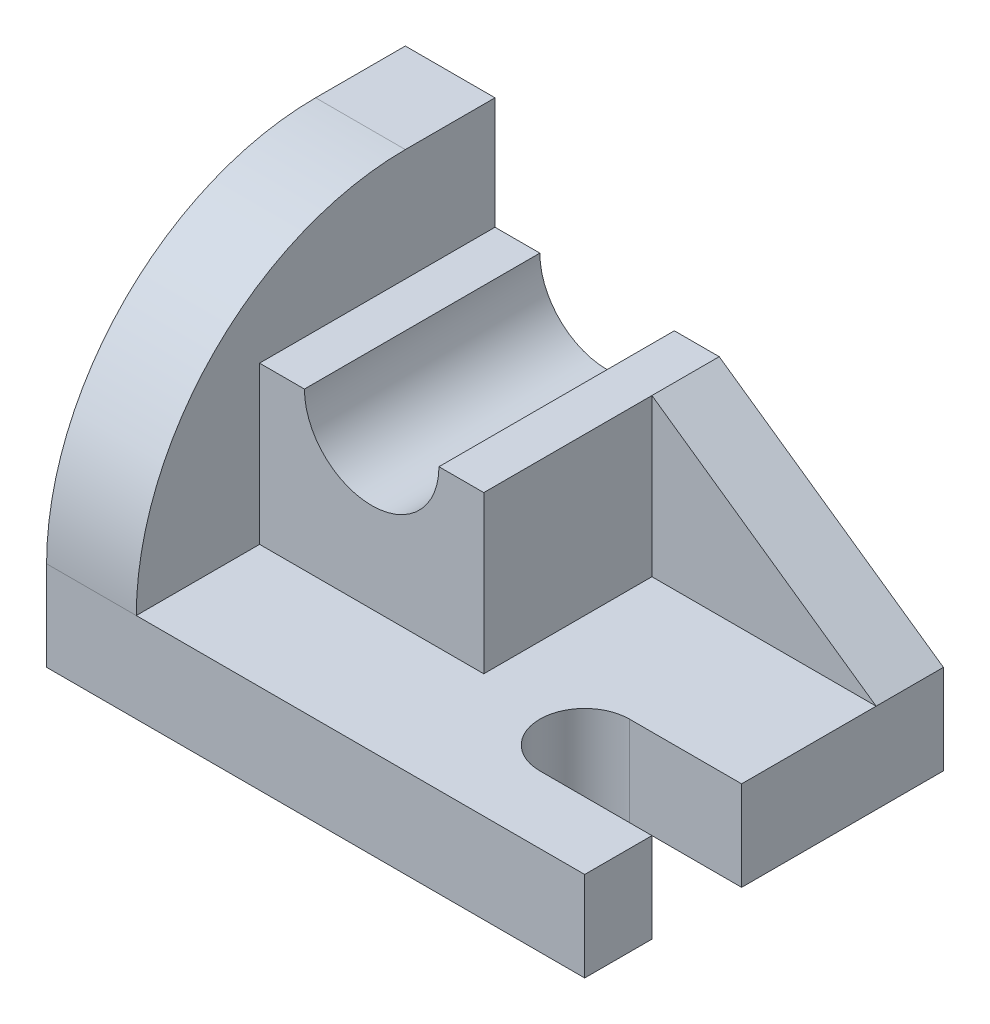
ISO-10303-21;
HEADER;
FILE_DESCRIPTION(('STEP AP214'),'2;1');
FILE_NAME('part.step','',(''),(''),'','','');
FILE_SCHEMA(('AUTOMOTIVE_DESIGN { 1 0 10303 214 1 1 1 1 }'));
ENDSEC;
DATA;
#1=APPLICATION_CONTEXT('core data for automotive mechanical design processes');
#2=APPLICATION_PROTOCOL_DEFINITION('international standard','automotive_design',2000,#1);
#3=PRODUCT_CONTEXT('',#1,'mechanical');
#4=PRODUCT('Part','Part','',(#3));
#5=PRODUCT_RELATED_PRODUCT_CATEGORY('part','',(#4));
#6=PRODUCT_DEFINITION_FORMATION('','',#4);
#7=PRODUCT_DEFINITION_CONTEXT('part definition',#1,'design');
#8=PRODUCT_DEFINITION('design','',#6,#7);
#9=PRODUCT_DEFINITION_SHAPE('','',#8);
#10=(LENGTH_UNIT() NAMED_UNIT(*) SI_UNIT(.MILLI.,.METRE.));
#11=(NAMED_UNIT(*) PLANE_ANGLE_UNIT() SI_UNIT($,.RADIAN.));
#12=(NAMED_UNIT(*) SI_UNIT($,.STERADIAN.) SOLID_ANGLE_UNIT());
#13=UNCERTAINTY_MEASURE_WITH_UNIT(LENGTH_MEASURE(1.E-05),#10,'distance_accuracy_value','');
#14=(GEOMETRIC_REPRESENTATION_CONTEXT(3) GLOBAL_UNCERTAINTY_ASSIGNED_CONTEXT((#13)) GLOBAL_UNIT_ASSIGNED_CONTEXT((#10,
#11,#12)) REPRESENTATION_CONTEXT('',''));
#15=CARTESIAN_POINT('',(0.,0.,0.));
#16=DIRECTION('',(0.,0.,1.));
#17=DIRECTION('',(1.,0.,0.));
#18=AXIS2_PLACEMENT_3D('',#15,#16,#17);
#19=CARTESIAN_POINT('',(0.,8.,0.));
#20=DIRECTION('',(0.,1.,0.));
#21=DIRECTION('',(0.,0.,1.));
#22=AXIS2_PLACEMENT_3D('',#19,#20,#21);
#23=PLANE('',#22);
#24=DIRECTION('',(-1.,0.,0.));
#25=VECTOR('',#24,1.);
#26=CARTESIAN_POINT('',(48.,8.,-20.));
#27=LINE('',#26,#25);
#28=CARTESIAN_POINT('',(48.,8.,-20.));
#29=VERTEX_POINT('',#28);
#30=CARTESIAN_POINT('',(7.99999999999999,8.,-20.));
#31=VERTEX_POINT('',#30);
#32=EDGE_CURVE('E239',#29,#31,#27,.T.);
#33=ORIENTED_EDGE('',*,*,#32,.T.);
#34=DIRECTION('',(0.,0.,-1.));
#35=VECTOR('',#34,1.);
#36=CARTESIAN_POINT('',(7.99999999999999,8.,10.));
#37=LINE('',#36,#35);
#38=CARTESIAN_POINT('',(7.99999999999999,8.,10.));
#39=VERTEX_POINT('',#38);
#40=EDGE_CURVE('E194',#39,#31,#37,.T.);
#41=ORIENTED_EDGE('',*,*,#40,.F.);
#42=DIRECTION('',(1.,0.,0.));
#43=VECTOR('',#42,1.);
#44=CARTESIAN_POINT('',(0.,8.,10.));
#45=LINE('',#44,#43);
#46=CARTESIAN_POINT('',(-32.,8.,10.));
#47=VERTEX_POINT('',#46);
#48=EDGE_CURVE('E219',#47,#39,#45,.T.);
#49=ORIENTED_EDGE('',*,*,#48,.F.);
#50=DIRECTION('',(0.,0.,1.));
#51=VECTOR('',#50,1.);
#52=CARTESIAN_POINT('',(-32.,8.,-32.));
#53=LINE('',#52,#51);
#54=CARTESIAN_POINT('',(-32.,8.,32.));
#55=VERTEX_POINT('',#54);
#56=EDGE_CURVE('E55',#47,#55,#53,.T.);
#57=ORIENTED_EDGE('',*,*,#56,.T.);
#58=DIRECTION('',(1.,0.,0.));
#59=VECTOR('',#58,1.);
#60=CARTESIAN_POINT('',(0.,8.,32.));
#61=LINE('',#60,#59);
#62=CARTESIAN_POINT('',(48.,8.,32.));
#63=VERTEX_POINT('',#62);
#64=EDGE_CURVE('E106',#55,#63,#61,.T.);
#65=ORIENTED_EDGE('',*,*,#64,.T.);
#66=DIRECTION('',(0.,0.,-1.));
#67=VECTOR('',#66,1.);
#68=CARTESIAN_POINT('',(48.,8.,0.));
#69=LINE('',#68,#67);
#70=CARTESIAN_POINT('',(48.,8.,20.));
#71=VERTEX_POINT('',#70);
#72=EDGE_CURVE('E111',#63,#71,#69,.T.);
#73=ORIENTED_EDGE('',*,*,#72,.T.);
#74=DIRECTION('',(1.,0.,0.));
#75=VECTOR('',#74,1.);
#76=CARTESIAN_POINT('',(0.,8.,20.));
#77=LINE('',#76,#75);
#78=CARTESIAN_POINT('',(28.,8.,20.));
#79=VERTEX_POINT('',#78);
#80=EDGE_CURVE('E133',#79,#71,#77,.T.);
#81=ORIENTED_EDGE('',*,*,#80,.F.);
#82=CARTESIAN_POINT('',(28.,8.,12.));
#83=DIRECTION('',(0.,1.,0.));
#84=DIRECTION('',(0.,0.,1.));
#85=AXIS2_PLACEMENT_3D('',#82,#83,#84);
#86=CIRCLE('',#85,8.);
#87=CARTESIAN_POINT('',(28.,8.,4.));
#88=VERTEX_POINT('',#87);
#89=EDGE_CURVE('E146',#88,#79,#86,.T.);
#90=ORIENTED_EDGE('',*,*,#89,.F.);
#91=DIRECTION('',(1.,0.,0.));
#92=VECTOR('',#91,1.);
#93=CARTESIAN_POINT('',(0.,8.,4.));
#94=LINE('',#93,#92);
#95=CARTESIAN_POINT('',(48.,8.,4.));
#96=VERTEX_POINT('',#95);
#97=EDGE_CURVE('E142',#88,#96,#94,.T.);
#98=ORIENTED_EDGE('',*,*,#97,.T.);
#99=EDGE_CURVE('E117',#96,#29,#69,.T.);
#100=ORIENTED_EDGE('',*,*,#99,.T.);
#101=EDGE_LOOP('',(#33,#41,#49,#57,#65,#73,#81,#90,#98,#100));
#102=FACE_BOUND('',#101,.T.);
#103=ADVANCED_FACE('F39',(#102),#23,.T.);
#104=CARTESIAN_POINT('',(28.,8.,12.));
#105=DIRECTION('',(0.,-1.,0.));
#106=DIRECTION('',(0.,0.,-1.));
#107=AXIS2_PLACEMENT_3D('',#104,#105,#106);
#108=CYLINDRICAL_SURFACE('',#107,8.);
#109=CARTESIAN_POINT('',(28.,-8.,12.));
#110=DIRECTION('',(0.,1.,0.));
#111=DIRECTION('',(0.,0.,1.));
#112=AXIS2_PLACEMENT_3D('',#109,#110,#111);
#113=CIRCLE('',#112,8.);
#114=CARTESIAN_POINT('',(28.,-8.,4.));
#115=VERTEX_POINT('',#114);
#116=CARTESIAN_POINT('',(28.,-8.,20.));
#117=VERTEX_POINT('',#116);
#118=EDGE_CURVE('E162',#115,#117,#113,.T.);
#119=ORIENTED_EDGE('',*,*,#118,.F.);
#120=DIRECTION('',(0.,-1.,0.));
#121=VECTOR('',#120,1.);
#122=CARTESIAN_POINT('',(28.,8.,4.));
#123=LINE('',#122,#121);
#124=EDGE_CURVE('E11',#88,#115,#123,.T.);
#125=ORIENTED_EDGE('',*,*,#124,.F.);
#126=ORIENTED_EDGE('',*,*,#89,.T.);
#127=DIRECTION('',(0.,-1.,0.));
#128=VECTOR('',#127,1.);
#129=CARTESIAN_POINT('',(28.,8.,20.));
#130=LINE('',#129,#128);
#131=EDGE_CURVE('E64',#79,#117,#130,.T.);
#132=ORIENTED_EDGE('',*,*,#131,.T.);
#133=EDGE_LOOP('',(#119,#125,#126,#132));
#134=FACE_BOUND('',#133,.T.);
#135=ADVANCED_FACE('F41',(#134),#108,.F.);
#136=CARTESIAN_POINT('',(0.,8.,4.));
#137=DIRECTION('',(0.,0.,-1.));
#138=DIRECTION('',(-1.,0.,0.));
#139=AXIS2_PLACEMENT_3D('',#136,#137,#138);
#140=PLANE('',#139);
#141=DIRECTION('',(1.,0.,0.));
#142=VECTOR('',#141,1.);
#143=CARTESIAN_POINT('',(0.,-8.,4.));
#144=LINE('',#143,#142);
#145=CARTESIAN_POINT('',(48.,-8.,4.));
#146=VERTEX_POINT('',#145);
#147=EDGE_CURVE('E369',#115,#146,#144,.T.);
#148=ORIENTED_EDGE('',*,*,#147,.T.);
#149=DIRECTION('',(0.,-1.,0.));
#150=VECTOR('',#149,1.);
#151=CARTESIAN_POINT('',(48.,8.,4.));
#152=LINE('',#151,#150);
#153=EDGE_CURVE('E48',#96,#146,#152,.T.);
#154=ORIENTED_EDGE('',*,*,#153,.F.);
#155=ORIENTED_EDGE('',*,*,#97,.F.);
#156=ORIENTED_EDGE('',*,*,#124,.T.);
#157=EDGE_LOOP('',(#148,#154,#155,#156));
#158=FACE_BOUND('',#157,.T.);
#159=ADVANCED_FACE('F376',(#158),#140,.F.);
#160=CARTESIAN_POINT('',(48.,8.,0.));
#161=DIRECTION('',(-1.,0.,0.));
#162=DIRECTION('',(0.,0.,1.));
#163=AXIS2_PLACEMENT_3D('',#160,#161,#162);
#164=PLANE('',#163);
#165=DIRECTION('',(0.,0.,-1.));
#166=VECTOR('',#165,1.);
#167=CARTESIAN_POINT('',(48.,-8.,0.));
#168=LINE('',#167,#166);
#169=CARTESIAN_POINT('',(48.,-8.,-32.));
#170=VERTEX_POINT('',#169);
#171=EDGE_CURVE('E348',#146,#170,#168,.T.);
#172=ORIENTED_EDGE('',*,*,#171,.T.);
#173=DIRECTION('',(0.,-1.,0.));
#174=VECTOR('',#173,1.);
#175=CARTESIAN_POINT('',(48.,8.,-32.));
#176=LINE('',#175,#174);
#177=CARTESIAN_POINT('',(48.,8.,-32.));
#178=VERTEX_POINT('',#177);
#179=EDGE_CURVE('E327',#178,#170,#176,.T.);
#180=ORIENTED_EDGE('',*,*,#179,.F.);
#181=DIRECTION('',(0.,0.,-1.));
#182=VECTOR('',#181,1.);
#183=CARTESIAN_POINT('',(48.,8.,-20.));
#184=LINE('',#183,#182);
#185=EDGE_CURVE('E214',#29,#178,#184,.T.);
#186=ORIENTED_EDGE('',*,*,#185,.F.);
#187=ORIENTED_EDGE('',*,*,#99,.F.);
#188=ORIENTED_EDGE('',*,*,#153,.T.);
#189=EDGE_LOOP('',(#172,#180,#186,#187,#188));
#190=FACE_BOUND('',#189,.T.);
#191=ADVANCED_FACE('F364',(#190),#164,.F.);
#192=CARTESIAN_POINT('',(0.,8.,-32.));
#193=DIRECTION('',(0.,0.,-1.));
#194=DIRECTION('',(-1.,0.,0.));
#195=AXIS2_PLACEMENT_3D('',#192,#193,#194);
#196=PLANE('',#195);
#197=DIRECTION('',(0.81923192051904,-0.573462344363328,0.));
#198=VECTOR('',#197,1.);
#199=CARTESIAN_POINT('',(7.99999999999999,36.,-32.));
#200=LINE('',#199,#198);
#201=CARTESIAN_POINT('',(7.99999999999999,36.,-32.));
#202=VERTEX_POINT('',#201);
#203=EDGE_CURVE('E243',#202,#178,#200,.T.);
#204=ORIENTED_EDGE('',*,*,#203,.T.);
#205=ORIENTED_EDGE('',*,*,#179,.T.);
#206=DIRECTION('',(1.,0.,0.));
#207=VECTOR('',#206,1.);
#208=CARTESIAN_POINT('',(0.,-8.,-32.));
#209=LINE('',#208,#207);
#210=CARTESIAN_POINT('',(-48.,-8.,-32.));
#211=VERTEX_POINT('',#210);
#212=EDGE_CURVE('E322',#211,#170,#209,.T.);
#213=ORIENTED_EDGE('',*,*,#212,.F.);
#214=DIRECTION('',(0.,-1.,0.));
#215=VECTOR('',#214,1.);
#216=CARTESIAN_POINT('',(-48.,8.,-32.));
#217=LINE('',#216,#215);
#218=CARTESIAN_POINT('',(-48.,56.,-32.));
#219=VERTEX_POINT('',#218);
#220=EDGE_CURVE('E318',#219,#211,#217,.T.);
#221=ORIENTED_EDGE('',*,*,#220,.F.);
#222=DIRECTION('',(-1.,0.,0.));
#223=VECTOR('',#222,1.);
#224=CARTESIAN_POINT('',(-32.,56.,-32.));
#225=LINE('',#224,#223);
#226=CARTESIAN_POINT('',(-32.,56.,-32.));
#227=VERTEX_POINT('',#226);
#228=EDGE_CURVE('E157',#227,#219,#225,.T.);
#229=ORIENTED_EDGE('',*,*,#228,.F.);
#230=DIRECTION('',(0.,-1.,0.));
#231=VECTOR('',#230,1.);
#232=CARTESIAN_POINT('',(-32.,8.,-32.));
#233=LINE('',#232,#231);
#234=CARTESIAN_POINT('',(-32.,36.,-32.));
#235=VERTEX_POINT('',#234);
#236=EDGE_CURVE('E167',#227,#235,#233,.T.);
#237=ORIENTED_EDGE('',*,*,#236,.T.);
#238=DIRECTION('',(1.,0.,0.));
#239=VECTOR('',#238,1.);
#240=CARTESIAN_POINT('',(0.,36.,-32.));
#241=LINE('',#240,#239);
#242=CARTESIAN_POINT('',(-24.,36.,-32.));
#243=VERTEX_POINT('',#242);
#244=EDGE_CURVE('E209',#235,#243,#241,.T.);
#245=ORIENTED_EDGE('',*,*,#244,.T.);
#246=CARTESIAN_POINT('',(-12.,36.,-32.));
#247=DIRECTION('',(0.,0.,-1.));
#248=DIRECTION('',(-1.,0.,0.));
#249=AXIS2_PLACEMENT_3D('',#246,#247,#248);
#250=CIRCLE('',#249,12.);
#251=CARTESIAN_POINT('',(0.,36.,-32.));
#252=VERTEX_POINT('',#251);
#253=EDGE_CURVE('E210',#252,#243,#250,.T.);
#254=ORIENTED_EDGE('',*,*,#253,.F.);
#255=EDGE_CURVE('E205',#252,#202,#241,.T.);
#256=ORIENTED_EDGE('',*,*,#255,.T.);
#257=EDGE_LOOP('',(#204,#205,#213,#221,#229,#237,#245,#254,#256));
#258=FACE_BOUND('',#257,.T.);
#259=ADVANCED_FACE('F319',(#258),#196,.T.);
#260=CARTESIAN_POINT('',(-48.,8.,0.));
#261=DIRECTION('',(-1.,0.,0.));
#262=DIRECTION('',(0.,0.,1.));
#263=AXIS2_PLACEMENT_3D('',#260,#261,#262);
#264=PLANE('',#263);
#265=DIRECTION('',(0.,0.,-1.));
#266=VECTOR('',#265,1.);
#267=CARTESIAN_POINT('',(-48.,-8.,0.));
#268=LINE('',#267,#266);
#269=CARTESIAN_POINT('',(-48.,-8.,32.));
#270=VERTEX_POINT('',#269);
#271=EDGE_CURVE('E340',#270,#211,#268,.T.);
#272=ORIENTED_EDGE('',*,*,#271,.F.);
#273=DIRECTION('',(0.,-1.,0.));
#274=VECTOR('',#273,1.);
#275=CARTESIAN_POINT('',(-48.,8.,32.));
#276=LINE('',#275,#274);
#277=CARTESIAN_POINT('',(-48.,8.,32.));
#278=VERTEX_POINT('',#277);
#279=EDGE_CURVE('E128',#278,#270,#276,.T.);
#280=ORIENTED_EDGE('',*,*,#279,.F.);
#281=CARTESIAN_POINT('',(-48.,8.,-16.));
#282=DIRECTION('',(-1.,0.,0.));
#283=DIRECTION('',(0.,0.,1.));
#284=AXIS2_PLACEMENT_3D('',#281,#282,#283);
#285=CIRCLE('',#284,48.);
#286=CARTESIAN_POINT('',(-48.,56.,-16.));
#287=VERTEX_POINT('',#286);
#288=EDGE_CURVE('E168',#278,#287,#285,.T.);
#289=ORIENTED_EDGE('',*,*,#288,.T.);
#290=DIRECTION('',(0.,0.,-1.));
#291=VECTOR('',#290,1.);
#292=CARTESIAN_POINT('',(-48.,56.,-32.));
#293=LINE('',#292,#291);
#294=EDGE_CURVE('E163',#287,#219,#293,.T.);
#295=ORIENTED_EDGE('',*,*,#294,.T.);
#296=ORIENTED_EDGE('',*,*,#220,.T.);
#297=EDGE_LOOP('',(#272,#280,#289,#295,#296));
#298=FACE_BOUND('',#297,.T.);
#299=ADVANCED_FACE('F333',(#298),#264,.T.);
#300=CARTESIAN_POINT('',(0.,8.,32.));
#301=DIRECTION('',(0.,0.,-1.));
#302=DIRECTION('',(-1.,0.,0.));
#303=AXIS2_PLACEMENT_3D('',#300,#301,#302);
#304=PLANE('',#303);
#305=DIRECTION('',(1.,0.,0.));
#306=VECTOR('',#305,1.);
#307=CARTESIAN_POINT('',(0.,-8.,32.));
#308=LINE('',#307,#306);
#309=CARTESIAN_POINT('',(48.,-8.,32.));
#310=VERTEX_POINT('',#309);
#311=EDGE_CURVE('E123',#270,#310,#308,.T.);
#312=ORIENTED_EDGE('',*,*,#311,.T.);
#313=DIRECTION('',(0.,-1.,0.));
#314=VECTOR('',#313,1.);
#315=CARTESIAN_POINT('',(48.,8.,32.));
#316=LINE('',#315,#314);
#317=EDGE_CURVE('E120',#63,#310,#316,.T.);
#318=ORIENTED_EDGE('',*,*,#317,.F.);
#319=ORIENTED_EDGE('',*,*,#64,.F.);
#320=EDGE_CURVE('E116',#278,#55,#61,.T.);
#321=ORIENTED_EDGE('',*,*,#320,.F.);
#322=ORIENTED_EDGE('',*,*,#279,.T.);
#323=EDGE_LOOP('',(#312,#318,#319,#321,#322));
#324=FACE_BOUND('',#323,.T.);
#325=ADVANCED_FACE('F121',(#324),#304,.F.);
#326=CARTESIAN_POINT('',(48.,-8.,20.));
#327=VERTEX_POINT('',#326);
#328=EDGE_CURVE('E342',#310,#327,#168,.T.);
#329=ORIENTED_EDGE('',*,*,#328,.T.);
#330=DIRECTION('',(0.,-1.,0.));
#331=VECTOR('',#330,1.);
#332=CARTESIAN_POINT('',(48.,8.,20.));
#333=LINE('',#332,#331);
#334=EDGE_CURVE('E129',#71,#327,#333,.T.);
#335=ORIENTED_EDGE('',*,*,#334,.F.);
#336=ORIENTED_EDGE('',*,*,#72,.F.);
#337=ORIENTED_EDGE('',*,*,#317,.T.);
#338=EDGE_LOOP('',(#329,#335,#336,#337));
#339=FACE_BOUND('',#338,.T.);
#340=ADVANCED_FACE('F131',(#339),#164,.F.);
#341=CARTESIAN_POINT('',(0.,8.,20.));
#342=DIRECTION('',(0.,0.,-1.));
#343=DIRECTION('',(-1.,0.,0.));
#344=AXIS2_PLACEMENT_3D('',#341,#342,#343);
#345=PLANE('',#344);
#346=DIRECTION('',(1.,0.,0.));
#347=VECTOR('',#346,1.);
#348=CARTESIAN_POINT('',(0.,-8.,20.));
#349=LINE('',#348,#347);
#350=EDGE_CURVE('E150',#117,#327,#349,.T.);
#351=ORIENTED_EDGE('',*,*,#350,.F.);
#352=ORIENTED_EDGE('',*,*,#131,.F.);
#353=ORIENTED_EDGE('',*,*,#80,.T.);
#354=ORIENTED_EDGE('',*,*,#334,.T.);
#355=EDGE_LOOP('',(#351,#352,#353,#354));
#356=FACE_BOUND('',#355,.T.);
#357=ADVANCED_FACE('F374',(#356),#345,.T.);
#358=CARTESIAN_POINT('',(0.,-8.,0.));
#359=DIRECTION('',(0.,1.,0.));
#360=DIRECTION('',(0.,0.,1.));
#361=AXIS2_PLACEMENT_3D('',#358,#359,#360);
#362=PLANE('',#361);
#363=ORIENTED_EDGE('',*,*,#118,.T.);
#364=ORIENTED_EDGE('',*,*,#350,.T.);
#365=ORIENTED_EDGE('',*,*,#328,.F.);
#366=ORIENTED_EDGE('',*,*,#311,.F.);
#367=ORIENTED_EDGE('',*,*,#271,.T.);
#368=ORIENTED_EDGE('',*,*,#212,.T.);
#369=ORIENTED_EDGE('',*,*,#171,.F.);
#370=ORIENTED_EDGE('',*,*,#147,.F.);
#371=EDGE_LOOP('',(#363,#364,#365,#366,#367,#368,#369,#370));
#372=FACE_BOUND('',#371,.T.);
#373=ADVANCED_FACE('F339',(#372),#362,.F.);
#374=CARTESIAN_POINT('',(-32.,56.,-32.));
#375=DIRECTION('',(0.,1.,0.));
#376=DIRECTION('',(0.,0.,1.));
#377=AXIS2_PLACEMENT_3D('',#374,#375,#376);
#378=PLANE('',#377);
#379=ORIENTED_EDGE('',*,*,#294,.F.);
#380=DIRECTION('',(-1.,0.,0.));
#381=VECTOR('',#380,1.);
#382=CARTESIAN_POINT('',(-32.,56.,-16.));
#383=LINE('',#382,#381);
#384=CARTESIAN_POINT('',(-32.,56.,-16.));
#385=VERTEX_POINT('',#384);
#386=EDGE_CURVE('E153',#385,#287,#383,.T.);
#387=ORIENTED_EDGE('',*,*,#386,.F.);
#388=DIRECTION('',(0.,0.,-1.));
#389=VECTOR('',#388,1.);
#390=CARTESIAN_POINT('',(-32.,56.,-32.));
#391=LINE('',#390,#389);
#392=EDGE_CURVE('E158',#385,#227,#391,.T.);
#393=ORIENTED_EDGE('',*,*,#392,.T.);
#394=ORIENTED_EDGE('',*,*,#228,.T.);
#395=EDGE_LOOP('',(#379,#387,#393,#394));
#396=FACE_BOUND('',#395,.T.);
#397=ADVANCED_FACE('F331',(#396),#378,.T.);
#398=CARTESIAN_POINT('',(-32.,8.,-16.));
#399=DIRECTION('',(-1.,0.,0.));
#400=DIRECTION('',(0.,0.,1.));
#401=AXIS2_PLACEMENT_3D('',#398,#399,#400);
#402=CYLINDRICAL_SURFACE('',#401,48.);
#403=ORIENTED_EDGE('',*,*,#288,.F.);
#404=ORIENTED_EDGE('',*,*,#320,.T.);
#405=CARTESIAN_POINT('',(-32.,8.,-16.));
#406=DIRECTION('',(-1.,0.,0.));
#407=DIRECTION('',(0.,0.,1.));
#408=AXIS2_PLACEMENT_3D('',#405,#406,#407);
#409=CIRCLE('',#408,48.);
#410=EDGE_CURVE('E176',#55,#385,#409,.T.);
#411=ORIENTED_EDGE('',*,*,#410,.T.);
#412=ORIENTED_EDGE('',*,*,#386,.T.);
#413=EDGE_LOOP('',(#403,#404,#411,#412));
#414=FACE_BOUND('',#413,.T.);
#415=ADVANCED_FACE('F335',(#414),#402,.T.);
#416=CARTESIAN_POINT('',(-32.,8.,-16.));
#417=DIRECTION('',(-1.,0.,0.));
#418=DIRECTION('',(0.,0.,1.));
#419=AXIS2_PLACEMENT_3D('',#416,#417,#418);
#420=PLANE('',#419);
#421=DIRECTION('',(0.,-1.,0.));
#422=VECTOR('',#421,1.);
#423=CARTESIAN_POINT('',(-32.,0.,10.));
#424=LINE('',#423,#422);
#425=CARTESIAN_POINT('',(-32.,36.,10.));
#426=VERTEX_POINT('',#425);
#427=EDGE_CURVE('E215',#426,#47,#424,.T.);
#428=ORIENTED_EDGE('',*,*,#427,.F.);
#429=DIRECTION('',(0.,0.,-1.));
#430=VECTOR('',#429,1.);
#431=CARTESIAN_POINT('',(-32.,36.,10.));
#432=LINE('',#431,#430);
#433=EDGE_CURVE('E198',#426,#235,#432,.T.);
#434=ORIENTED_EDGE('',*,*,#433,.T.);
#435=ORIENTED_EDGE('',*,*,#236,.F.);
#436=ORIENTED_EDGE('',*,*,#392,.F.);
#437=ORIENTED_EDGE('',*,*,#410,.F.);
#438=ORIENTED_EDGE('',*,*,#56,.F.);
#439=EDGE_LOOP('',(#428,#434,#435,#436,#437,#438));
#440=FACE_BOUND('',#439,.T.);
#441=ADVANCED_FACE('F457',(#440),#420,.F.);
#442=CARTESIAN_POINT('',(-12.,36.,10.));
#443=DIRECTION('',(0.,0.,-1.));
#444=DIRECTION('',(-1.,0.,0.));
#445=AXIS2_PLACEMENT_3D('',#442,#443,#444);
#446=CYLINDRICAL_SURFACE('',#445,12.);
#447=ORIENTED_EDGE('',*,*,#253,.T.);
#448=DIRECTION('',(0.,0.,-1.));
#449=VECTOR('',#448,1.);
#450=CARTESIAN_POINT('',(-24.,36.,10.));
#451=LINE('',#450,#449);
#452=CARTESIAN_POINT('',(-24.,36.,10.));
#453=VERTEX_POINT('',#452);
#454=EDGE_CURVE('E172',#453,#243,#451,.T.);
#455=ORIENTED_EDGE('',*,*,#454,.F.);
#456=CARTESIAN_POINT('',(-12.,36.,10.));
#457=DIRECTION('',(0.,0.,-1.));
#458=DIRECTION('',(-1.,0.,0.));
#459=AXIS2_PLACEMENT_3D('',#456,#457,#458);
#460=CIRCLE('',#459,12.);
#461=CARTESIAN_POINT('',(0.,36.,10.));
#462=VERTEX_POINT('',#461);
#463=EDGE_CURVE('E231',#462,#453,#460,.T.);
#464=ORIENTED_EDGE('',*,*,#463,.F.);
#465=DIRECTION('',(0.,0.,-1.));
#466=VECTOR('',#465,1.);
#467=CARTESIAN_POINT('',(0.,36.,10.));
#468=LINE('',#467,#466);
#469=EDGE_CURVE('E185',#462,#252,#468,.T.);
#470=ORIENTED_EDGE('',*,*,#469,.T.);
#471=EDGE_LOOP('',(#447,#455,#464,#470));
#472=FACE_BOUND('',#471,.T.);
#473=ADVANCED_FACE('F465',(#472),#446,.F.);
#474=CARTESIAN_POINT('',(0.,36.,10.));
#475=DIRECTION('',(0.,1.,0.));
#476=DIRECTION('',(0.,0.,1.));
#477=AXIS2_PLACEMENT_3D('',#474,#475,#476);
#478=PLANE('',#477);
#479=ORIENTED_EDGE('',*,*,#244,.F.);
#480=ORIENTED_EDGE('',*,*,#433,.F.);
#481=DIRECTION('',(1.,0.,0.));
#482=VECTOR('',#481,1.);
#483=CARTESIAN_POINT('',(0.,36.,10.));
#484=LINE('',#483,#482);
#485=EDGE_CURVE('E190',#426,#453,#484,.T.);
#486=ORIENTED_EDGE('',*,*,#485,.T.);
#487=ORIENTED_EDGE('',*,*,#454,.T.);
#488=EDGE_LOOP('',(#479,#480,#486,#487));
#489=FACE_BOUND('',#488,.T.);
#490=ADVANCED_FACE('F476',(#489),#478,.T.);
#491=CARTESIAN_POINT('',(7.99999999999999,0.,10.));
#492=DIRECTION('',(-1.,0.,0.));
#493=DIRECTION('',(0.,-1.,0.));
#494=AXIS2_PLACEMENT_3D('',#491,#492,#493);
#495=PLANE('',#494);
#496=ORIENTED_EDGE('',*,*,#40,.T.);
#497=DIRECTION('',(0.,1.,0.));
#498=VECTOR('',#497,1.);
#499=CARTESIAN_POINT('',(7.99999999999999,8.,-20.));
#500=LINE('',#499,#498);
#501=CARTESIAN_POINT('',(7.99999999999999,36.,-20.));
#502=VERTEX_POINT('',#501);
#503=EDGE_CURVE('E247',#31,#502,#500,.T.);
#504=ORIENTED_EDGE('',*,*,#503,.T.);
#505=DIRECTION('',(0.,0.,-1.));
#506=VECTOR('',#505,1.);
#507=CARTESIAN_POINT('',(7.99999999999999,36.,10.));
#508=LINE('',#507,#506);
#509=CARTESIAN_POINT('',(7.99999999999999,36.,10.));
#510=VERTEX_POINT('',#509);
#511=EDGE_CURVE('E189',#510,#502,#508,.T.);
#512=ORIENTED_EDGE('',*,*,#511,.F.);
#513=DIRECTION('',(0.,1.,0.));
#514=VECTOR('',#513,1.);
#515=CARTESIAN_POINT('',(7.99999999999999,0.,10.));
#516=LINE('',#515,#514);
#517=EDGE_CURVE('E223',#39,#510,#516,.T.);
#518=ORIENTED_EDGE('',*,*,#517,.F.);
#519=EDGE_LOOP('',(#496,#504,#512,#518));
#520=FACE_BOUND('',#519,.T.);
#521=ADVANCED_FACE('F260',(#520),#495,.F.);
#522=ORIENTED_EDGE('',*,*,#255,.F.);
#523=ORIENTED_EDGE('',*,*,#469,.F.);
#524=EDGE_CURVE('E227',#462,#510,#484,.T.);
#525=ORIENTED_EDGE('',*,*,#524,.T.);
#526=ORIENTED_EDGE('',*,*,#511,.T.);
#527=DIRECTION('',(0.,0.,-1.));
#528=VECTOR('',#527,1.);
#529=CARTESIAN_POINT('',(7.99999999999999,36.,-20.));
#530=LINE('',#529,#528);
#531=EDGE_CURVE('E235',#502,#202,#530,.T.);
#532=ORIENTED_EDGE('',*,*,#531,.T.);
#533=EDGE_LOOP('',(#522,#523,#525,#526,#532));
#534=FACE_BOUND('',#533,.T.);
#535=ADVANCED_FACE('F273',(#534),#478,.T.);
#536=CARTESIAN_POINT('',(0.,0.,10.));
#537=DIRECTION('',(0.,0.,-1.));
#538=DIRECTION('',(-1.,0.,0.));
#539=AXIS2_PLACEMENT_3D('',#536,#537,#538);
#540=PLANE('',#539);
#541=ORIENTED_EDGE('',*,*,#463,.T.);
#542=ORIENTED_EDGE('',*,*,#485,.F.);
#543=ORIENTED_EDGE('',*,*,#427,.T.);
#544=ORIENTED_EDGE('',*,*,#48,.T.);
#545=ORIENTED_EDGE('',*,*,#517,.T.);
#546=ORIENTED_EDGE('',*,*,#524,.F.);
#547=EDGE_LOOP('',(#541,#542,#543,#544,#545,#546));
#548=FACE_BOUND('',#547,.T.);
#549=ADVANCED_FACE('F282',(#548),#540,.F.);
#550=CARTESIAN_POINT('',(7.99999999999999,36.,-20.));
#551=DIRECTION('',(0.573462344363328,0.81923192051904,0.));
#552=DIRECTION('',(-0.81923192051904,0.573462344363328,0.));
#553=AXIS2_PLACEMENT_3D('',#550,#551,#552);
#554=PLANE('',#553);
#555=ORIENTED_EDGE('',*,*,#203,.F.);
#556=ORIENTED_EDGE('',*,*,#531,.F.);
#557=DIRECTION('',(0.81923192051904,-0.573462344363328,0.));
#558=VECTOR('',#557,1.);
#559=CARTESIAN_POINT('',(7.99999999999999,36.,-20.));
#560=LINE('',#559,#558);
#561=EDGE_CURVE('E250',#502,#29,#560,.T.);
#562=ORIENTED_EDGE('',*,*,#561,.T.);
#563=ORIENTED_EDGE('',*,*,#185,.T.);
#564=EDGE_LOOP('',(#555,#556,#562,#563));
#565=FACE_BOUND('',#564,.T.);
#566=ADVANCED_FACE('F497',(#565),#554,.T.);
#567=CARTESIAN_POINT('',(0.,0.,-20.));
#568=DIRECTION('',(0.,0.,1.));
#569=DIRECTION('',(1.,0.,0.));
#570=AXIS2_PLACEMENT_3D('',#567,#568,#569);
#571=PLANE('',#570);
#572=ORIENTED_EDGE('',*,*,#503,.F.);
#573=ORIENTED_EDGE('',*,*,#32,.F.);
#574=ORIENTED_EDGE('',*,*,#561,.F.);
#575=EDGE_LOOP('',(#572,#573,#574));
#576=FACE_BOUND('',#575,.T.);
#577=ADVANCED_FACE('F523',(#576),#571,.T.);
#578=CLOSED_SHELL('',(#103,#135,#159,#191,#259,#299,#325,#340,#357,#373,#397,#415,#441,#473,
#490,#521,#535,#549,#566,#577));
#579=MANIFOLD_SOLID_BREP('B2',#578);
#580=ADVANCED_BREP_SHAPE_REPRESENTATION('',(#18,#579),#14);
#581=SHAPE_DEFINITION_REPRESENTATION(#9,#580);
ENDSEC;
END-ISO-10303-21;
